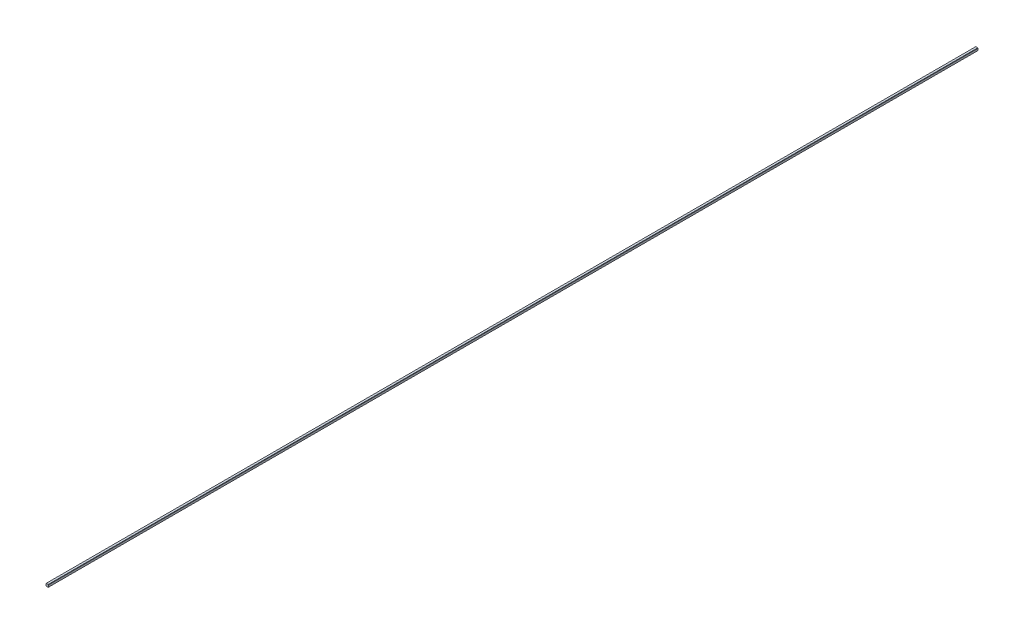
ISO-10303-21;
HEADER;
FILE_DESCRIPTION(('STEP AP214'),'2;1');
FILE_NAME('part.step','',(''),(''),'','','');
FILE_SCHEMA(('AUTOMOTIVE_DESIGN { 1 0 10303 214 1 1 1 1 }'));
ENDSEC;
DATA;
#1=APPLICATION_CONTEXT('core data for automotive mechanical design processes');
#2=APPLICATION_PROTOCOL_DEFINITION('international standard','automotive_design',2000,#1);
#3=PRODUCT_CONTEXT('',#1,'mechanical');
#4=PRODUCT('Part','Part','',(#3));
#5=PRODUCT_RELATED_PRODUCT_CATEGORY('part','',(#4));
#6=PRODUCT_DEFINITION_FORMATION('','',#4);
#7=PRODUCT_DEFINITION_CONTEXT('part definition',#1,'design');
#8=PRODUCT_DEFINITION('design','',#6,#7);
#9=PRODUCT_DEFINITION_SHAPE('','',#8);
#10=(LENGTH_UNIT() NAMED_UNIT(*) SI_UNIT(.MILLI.,.METRE.));
#11=(NAMED_UNIT(*) PLANE_ANGLE_UNIT() SI_UNIT($,.RADIAN.));
#12=(NAMED_UNIT(*) SI_UNIT($,.STERADIAN.) SOLID_ANGLE_UNIT());
#13=UNCERTAINTY_MEASURE_WITH_UNIT(LENGTH_MEASURE(1.E-05),#10,'distance_accuracy_value','');
#14=(GEOMETRIC_REPRESENTATION_CONTEXT(3) GLOBAL_UNCERTAINTY_ASSIGNED_CONTEXT((#13)) GLOBAL_UNIT_ASSIGNED_CONTEXT((#10,
#11,#12)) REPRESENTATION_CONTEXT('',''));
#15=CARTESIAN_POINT('',(0.,0.,0.));
#16=DIRECTION('',(0.,0.,1.));
#17=DIRECTION('',(1.,0.,0.));
#18=AXIS2_PLACEMENT_3D('',#15,#16,#17);
#19=CARTESIAN_POINT('',(0.2,0.25,185.));
#20=DIRECTION('',(0.,-1.,0.));
#21=DIRECTION('',(0.,0.,-1.));
#22=AXIS2_PLACEMENT_3D('',#19,#20,#21);
#23=PLANE('',#22);
#24=DIRECTION('',(-1.,0.,0.));
#25=VECTOR('',#24,1.);
#26=CARTESIAN_POINT('',(0.2,0.25,0.));
#27=LINE('',#26,#25);
#28=CARTESIAN_POINT('',(0.2,0.25,0.));
#29=VERTEX_POINT('',#28);
#30=CARTESIAN_POINT('',(-0.2,0.25,0.));
#31=VERTEX_POINT('',#30);
#32=EDGE_CURVE('E140',#29,#31,#27,.T.);
#33=ORIENTED_EDGE('',*,*,#32,.T.);
#34=DIRECTION('',(0.,0.,-1.));
#35=VECTOR('',#34,1.);
#36=CARTESIAN_POINT('',(-0.2,0.25,185.));
#37=LINE('',#36,#35);
#38=CARTESIAN_POINT('',(-0.2,0.25,185.));
#39=VERTEX_POINT('',#38);
#40=EDGE_CURVE('E11',#39,#31,#37,.T.);
#41=ORIENTED_EDGE('',*,*,#40,.F.);
#42=DIRECTION('',(-1.,0.,0.));
#43=VECTOR('',#42,1.);
#44=CARTESIAN_POINT('',(0.2,0.25,185.));
#45=LINE('',#44,#43);
#46=CARTESIAN_POINT('',(0.2,0.25,185.));
#47=VERTEX_POINT('',#46);
#48=EDGE_CURVE('E153',#47,#39,#45,.T.);
#49=ORIENTED_EDGE('',*,*,#48,.F.);
#50=DIRECTION('',(0.,0.,-1.));
#51=VECTOR('',#50,1.);
#52=CARTESIAN_POINT('',(0.2,0.25,185.));
#53=LINE('',#52,#51);
#54=EDGE_CURVE('E133',#47,#29,#53,.T.);
#55=ORIENTED_EDGE('',*,*,#54,.T.);
#56=EDGE_LOOP('',(#33,#41,#49,#55));
#57=FACE_BOUND('',#56,.T.);
#58=ADVANCED_FACE('F41',(#57),#23,.F.);
#59=CARTESIAN_POINT('',(-0.2,0.25,185.));
#60=DIRECTION('',(0.707106781186548,-0.707106781186547,0.));
#61=DIRECTION('',(0.707106781186547,0.707106781186548,0.));
#62=AXIS2_PLACEMENT_3D('',#59,#60,#61);
#63=PLANE('',#62);
#64=DIRECTION('',(-0.707106781186547,-0.707106781186548,0.));
#65=VECTOR('',#64,1.);
#66=CARTESIAN_POINT('',(-0.2,0.25,0.));
#67=LINE('',#66,#65);
#68=CARTESIAN_POINT('',(-0.25,0.2,0.));
#69=VERTEX_POINT('',#68);
#70=EDGE_CURVE('E139',#31,#69,#67,.T.);
#71=ORIENTED_EDGE('',*,*,#70,.T.);
#72=DIRECTION('',(0.,0.,-1.));
#73=VECTOR('',#72,1.);
#74=CARTESIAN_POINT('',(-0.25,0.2,185.));
#75=LINE('',#74,#73);
#76=CARTESIAN_POINT('',(-0.25,0.2,185.));
#77=VERTEX_POINT('',#76);
#78=EDGE_CURVE('E47',#77,#69,#75,.T.);
#79=ORIENTED_EDGE('',*,*,#78,.F.);
#80=DIRECTION('',(-0.707106781186547,-0.707106781186548,0.));
#81=VECTOR('',#80,1.);
#82=CARTESIAN_POINT('',(-0.2,0.25,185.));
#83=LINE('',#82,#81);
#84=EDGE_CURVE('E99',#39,#77,#83,.T.);
#85=ORIENTED_EDGE('',*,*,#84,.F.);
#86=ORIENTED_EDGE('',*,*,#40,.T.);
#87=EDGE_LOOP('',(#71,#79,#85,#86));
#88=FACE_BOUND('',#87,.T.);
#89=ADVANCED_FACE('F190',(#88),#63,.F.);
#90=CARTESIAN_POINT('',(-0.25,0.2,185.));
#91=DIRECTION('',(1.,0.,0.));
#92=DIRECTION('',(0.,1.,0.));
#93=AXIS2_PLACEMENT_3D('',#90,#91,#92);
#94=PLANE('',#93);
#95=DIRECTION('',(0.,-1.,0.));
#96=VECTOR('',#95,1.);
#97=CARTESIAN_POINT('',(-0.25,0.2,0.));
#98=LINE('',#97,#96);
#99=CARTESIAN_POINT('',(-0.25,-0.2,0.));
#100=VERTEX_POINT('',#99);
#101=EDGE_CURVE('E145',#69,#100,#98,.T.);
#102=ORIENTED_EDGE('',*,*,#101,.T.);
#103=DIRECTION('',(0.,0.,-1.));
#104=VECTOR('',#103,1.);
#105=CARTESIAN_POINT('',(-0.25,-0.2,185.));
#106=LINE('',#105,#104);
#107=CARTESIAN_POINT('',(-0.25,-0.2,185.));
#108=VERTEX_POINT('',#107);
#109=EDGE_CURVE('E159',#108,#100,#106,.T.);
#110=ORIENTED_EDGE('',*,*,#109,.F.);
#111=DIRECTION('',(0.,-1.,0.));
#112=VECTOR('',#111,1.);
#113=CARTESIAN_POINT('',(-0.25,0.2,185.));
#114=LINE('',#113,#112);
#115=EDGE_CURVE('E167',#77,#108,#114,.T.);
#116=ORIENTED_EDGE('',*,*,#115,.F.);
#117=ORIENTED_EDGE('',*,*,#78,.T.);
#118=EDGE_LOOP('',(#102,#110,#116,#117));
#119=FACE_BOUND('',#118,.T.);
#120=ADVANCED_FACE('F164',(#119),#94,.F.);
#121=CARTESIAN_POINT('',(-0.2,-0.25,185.));
#122=DIRECTION('',(0.707106781186547,0.707106781186547,0.));
#123=DIRECTION('',(-0.707106781186548,0.707106781186548,0.));
#124=AXIS2_PLACEMENT_3D('',#121,#122,#123);
#125=PLANE('',#124);
#126=DIRECTION('',(0.707106781186547,-0.707106781186547,0.));
#127=VECTOR('',#126,1.);
#128=CARTESIAN_POINT('',(-0.2,-0.25,0.));
#129=LINE('',#128,#127);
#130=CARTESIAN_POINT('',(-0.2,-0.25,0.));
#131=VERTEX_POINT('',#130);
#132=EDGE_CURVE('E143',#100,#131,#129,.T.);
#133=ORIENTED_EDGE('',*,*,#132,.T.);
#134=DIRECTION('',(0.,0.,-1.));
#135=VECTOR('',#134,1.);
#136=CARTESIAN_POINT('',(-0.2,-0.25,185.));
#137=LINE('',#136,#135);
#138=CARTESIAN_POINT('',(-0.2,-0.25,185.));
#139=VERTEX_POINT('',#138);
#140=EDGE_CURVE('E157',#139,#131,#137,.T.);
#141=ORIENTED_EDGE('',*,*,#140,.F.);
#142=DIRECTION('',(0.707106781186547,-0.707106781186547,0.));
#143=VECTOR('',#142,1.);
#144=CARTESIAN_POINT('',(-0.2,-0.25,185.));
#145=LINE('',#144,#143);
#146=EDGE_CURVE('E177',#108,#139,#145,.T.);
#147=ORIENTED_EDGE('',*,*,#146,.F.);
#148=ORIENTED_EDGE('',*,*,#109,.T.);
#149=EDGE_LOOP('',(#133,#141,#147,#148));
#150=FACE_BOUND('',#149,.T.);
#151=ADVANCED_FACE('F172',(#150),#125,.F.);
#152=CARTESIAN_POINT('',(0.2,-0.25,185.));
#153=DIRECTION('',(0.,1.,0.));
#154=DIRECTION('',(-1.,0.,0.));
#155=AXIS2_PLACEMENT_3D('',#152,#153,#154);
#156=PLANE('',#155);
#157=DIRECTION('',(1.,0.,0.));
#158=VECTOR('',#157,1.);
#159=CARTESIAN_POINT('',(0.2,-0.25,0.));
#160=LINE('',#159,#158);
#161=CARTESIAN_POINT('',(0.2,-0.25,0.));
#162=VERTEX_POINT('',#161);
#163=EDGE_CURVE('E147',#131,#162,#160,.T.);
#164=ORIENTED_EDGE('',*,*,#163,.T.);
#165=DIRECTION('',(0.,0.,-1.));
#166=VECTOR('',#165,1.);
#167=CARTESIAN_POINT('',(0.2,-0.25,185.));
#168=LINE('',#167,#166);
#169=CARTESIAN_POINT('',(0.2,-0.25,185.));
#170=VERTEX_POINT('',#169);
#171=EDGE_CURVE('E126',#170,#162,#168,.T.);
#172=ORIENTED_EDGE('',*,*,#171,.F.);
#173=DIRECTION('',(1.,0.,0.));
#174=VECTOR('',#173,1.);
#175=CARTESIAN_POINT('',(0.2,-0.25,185.));
#176=LINE('',#175,#174);
#177=EDGE_CURVE('E117',#139,#170,#176,.T.);
#178=ORIENTED_EDGE('',*,*,#177,.F.);
#179=ORIENTED_EDGE('',*,*,#140,.T.);
#180=EDGE_LOOP('',(#164,#172,#178,#179));
#181=FACE_BOUND('',#180,.T.);
#182=ADVANCED_FACE('F178',(#181),#156,.F.);
#183=CARTESIAN_POINT('',(0.25,-0.2,185.));
#184=DIRECTION('',(-0.707106781186547,0.707106781186547,0.));
#185=DIRECTION('',(-0.707106781186548,-0.707106781186548,0.));
#186=AXIS2_PLACEMENT_3D('',#183,#184,#185);
#187=PLANE('',#186);
#188=DIRECTION('',(0.707106781186547,0.707106781186547,0.));
#189=VECTOR('',#188,1.);
#190=CARTESIAN_POINT('',(0.25,-0.2,0.));
#191=LINE('',#190,#189);
#192=CARTESIAN_POINT('',(0.25,-0.2,0.));
#193=VERTEX_POINT('',#192);
#194=EDGE_CURVE('E130',#162,#193,#191,.T.);
#195=ORIENTED_EDGE('',*,*,#194,.T.);
#196=DIRECTION('',(0.,0.,-1.));
#197=VECTOR('',#196,1.);
#198=CARTESIAN_POINT('',(0.25,-0.2,185.));
#199=LINE('',#198,#197);
#200=CARTESIAN_POINT('',(0.25,-0.2,185.));
#201=VERTEX_POINT('',#200);
#202=EDGE_CURVE('E125',#201,#193,#199,.T.);
#203=ORIENTED_EDGE('',*,*,#202,.F.);
#204=DIRECTION('',(0.707106781186547,0.707106781186547,0.));
#205=VECTOR('',#204,1.);
#206=CARTESIAN_POINT('',(0.25,-0.2,185.));
#207=LINE('',#206,#205);
#208=EDGE_CURVE('E111',#170,#201,#207,.T.);
#209=ORIENTED_EDGE('',*,*,#208,.F.);
#210=ORIENTED_EDGE('',*,*,#171,.T.);
#211=EDGE_LOOP('',(#195,#203,#209,#210));
#212=FACE_BOUND('',#211,.T.);
#213=ADVANCED_FACE('F124',(#212),#187,.F.);
#214=CARTESIAN_POINT('',(0.25,0.2,185.));
#215=DIRECTION('',(-1.,0.,0.));
#216=DIRECTION('',(0.,-1.,0.));
#217=AXIS2_PLACEMENT_3D('',#214,#215,#216);
#218=PLANE('',#217);
#219=DIRECTION('',(0.,1.,0.));
#220=VECTOR('',#219,1.);
#221=CARTESIAN_POINT('',(0.25,0.2,0.));
#222=LINE('',#221,#220);
#223=CARTESIAN_POINT('',(0.25,0.2,0.));
#224=VERTEX_POINT('',#223);
#225=EDGE_CURVE('E86',#193,#224,#222,.T.);
#226=ORIENTED_EDGE('',*,*,#225,.T.);
#227=DIRECTION('',(0.,0.,-1.));
#228=VECTOR('',#227,1.);
#229=CARTESIAN_POINT('',(0.25,0.2,185.));
#230=LINE('',#229,#228);
#231=CARTESIAN_POINT('',(0.25,0.2,185.));
#232=VERTEX_POINT('',#231);
#233=EDGE_CURVE('E129',#232,#224,#230,.T.);
#234=ORIENTED_EDGE('',*,*,#233,.F.);
#235=DIRECTION('',(0.,1.,0.));
#236=VECTOR('',#235,1.);
#237=CARTESIAN_POINT('',(0.25,0.2,185.));
#238=LINE('',#237,#236);
#239=EDGE_CURVE('E120',#201,#232,#238,.T.);
#240=ORIENTED_EDGE('',*,*,#239,.F.);
#241=ORIENTED_EDGE('',*,*,#202,.T.);
#242=EDGE_LOOP('',(#226,#234,#240,#241));
#243=FACE_BOUND('',#242,.T.);
#244=ADVANCED_FACE('F131',(#243),#218,.F.);
#245=CARTESIAN_POINT('',(0.25,0.2,185.));
#246=DIRECTION('',(-0.707106781186547,-0.707106781186547,0.));
#247=DIRECTION('',(0.707106781186548,-0.707106781186548,0.));
#248=AXIS2_PLACEMENT_3D('',#245,#246,#247);
#249=PLANE('',#248);
#250=DIRECTION('',(-0.707106781186547,0.707106781186547,0.));
#251=VECTOR('',#250,1.);
#252=CARTESIAN_POINT('',(0.25,0.2,0.));
#253=LINE('',#252,#251);
#254=EDGE_CURVE('E95',#224,#29,#253,.T.);
#255=ORIENTED_EDGE('',*,*,#254,.T.);
#256=ORIENTED_EDGE('',*,*,#54,.F.);
#257=DIRECTION('',(-0.707106781186547,0.707106781186547,0.));
#258=VECTOR('',#257,1.);
#259=CARTESIAN_POINT('',(0.25,0.2,185.));
#260=LINE('',#259,#258);
#261=EDGE_CURVE('E60',#232,#47,#260,.T.);
#262=ORIENTED_EDGE('',*,*,#261,.F.);
#263=ORIENTED_EDGE('',*,*,#233,.T.);
#264=EDGE_LOOP('',(#255,#256,#262,#263));
#265=FACE_BOUND('',#264,.T.);
#266=ADVANCED_FACE('F201',(#265),#249,.F.);
#267=CARTESIAN_POINT('',(0.,0.,185.));
#268=DIRECTION('',(0.,0.,1.));
#269=DIRECTION('',(1.,0.,0.));
#270=AXIS2_PLACEMENT_3D('',#267,#268,#269);
#271=PLANE('',#270);
#272=ORIENTED_EDGE('',*,*,#48,.T.);
#273=ORIENTED_EDGE('',*,*,#84,.T.);
#274=ORIENTED_EDGE('',*,*,#115,.T.);
#275=ORIENTED_EDGE('',*,*,#146,.T.);
#276=ORIENTED_EDGE('',*,*,#177,.T.);
#277=ORIENTED_EDGE('',*,*,#208,.T.);
#278=ORIENTED_EDGE('',*,*,#239,.T.);
#279=ORIENTED_EDGE('',*,*,#261,.T.);
#280=EDGE_LOOP('',(#272,#273,#274,#275,#276,#277,#278,#279));
#281=FACE_BOUND('',#280,.T.);
#282=ADVANCED_FACE('F113',(#281),#271,.T.);
#283=CARTESIAN_POINT('',(0.,0.,0.));
#284=DIRECTION('',(0.,0.,1.));
#285=DIRECTION('',(1.,0.,0.));
#286=AXIS2_PLACEMENT_3D('',#283,#284,#285);
#287=PLANE('',#286);
#288=ORIENTED_EDGE('',*,*,#32,.F.);
#289=ORIENTED_EDGE('',*,*,#254,.F.);
#290=ORIENTED_EDGE('',*,*,#225,.F.);
#291=ORIENTED_EDGE('',*,*,#194,.F.);
#292=ORIENTED_EDGE('',*,*,#163,.F.);
#293=ORIENTED_EDGE('',*,*,#132,.F.);
#294=ORIENTED_EDGE('',*,*,#101,.F.);
#295=ORIENTED_EDGE('',*,*,#70,.F.);
#296=EDGE_LOOP('',(#288,#289,#290,#291,#292,#293,#294,#295));
#297=FACE_BOUND('',#296,.T.);
#298=ADVANCED_FACE('F173',(#297),#287,.F.);
#299=CLOSED_SHELL('',(#58,#89,#120,#151,#182,#213,#244,#266,#282,#298));
#300=MANIFOLD_SOLID_BREP('B2',#299);
#301=ADVANCED_BREP_SHAPE_REPRESENTATION('',(#18,#300),#14);
#302=SHAPE_DEFINITION_REPRESENTATION(#9,#301);
ENDSEC;
END-ISO-10303-21;
